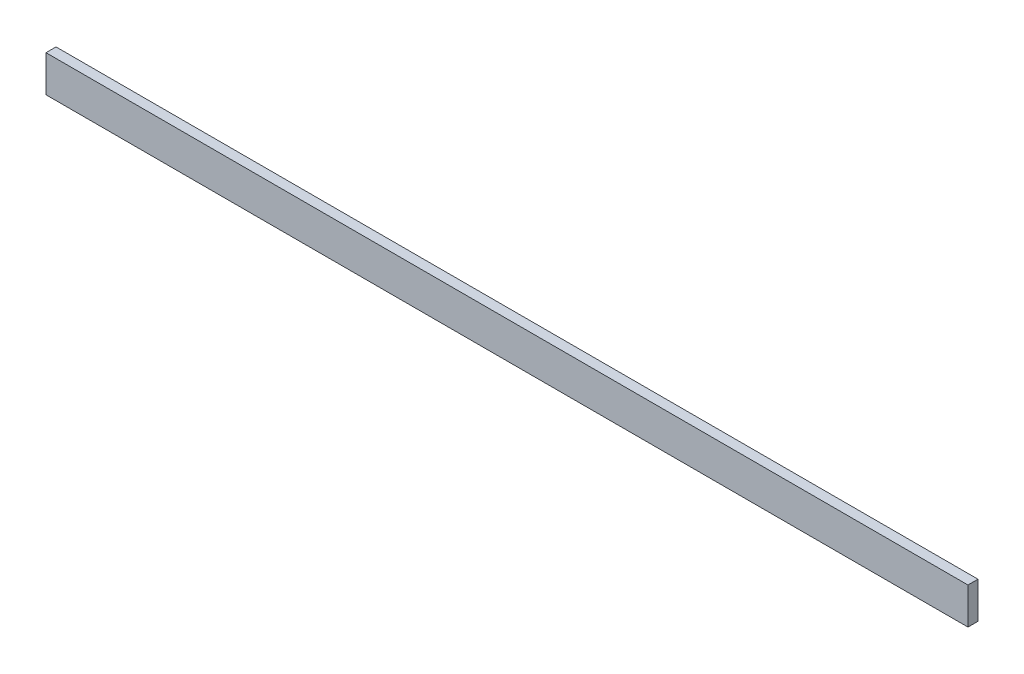
ISO-10303-21;
HEADER;
FILE_DESCRIPTION(('STEP AP214'),'2;1');
FILE_NAME('part.step','',(''),(''),'','','');
FILE_SCHEMA(('AUTOMOTIVE_DESIGN { 1 0 10303 214 1 1 1 1 }'));
ENDSEC;
DATA;
#1=APPLICATION_CONTEXT('core data for automotive mechanical design processes');
#2=APPLICATION_PROTOCOL_DEFINITION('international standard','automotive_design',2000,#1);
#3=PRODUCT_CONTEXT('',#1,'mechanical');
#4=PRODUCT('Part','Part','',(#3));
#5=PRODUCT_RELATED_PRODUCT_CATEGORY('part','',(#4));
#6=PRODUCT_DEFINITION_FORMATION('','',#4);
#7=PRODUCT_DEFINITION_CONTEXT('part definition',#1,'design');
#8=PRODUCT_DEFINITION('design','',#6,#7);
#9=PRODUCT_DEFINITION_SHAPE('','',#8);
#10=(LENGTH_UNIT() NAMED_UNIT(*) SI_UNIT(.MILLI.,.METRE.));
#11=(NAMED_UNIT(*) PLANE_ANGLE_UNIT() SI_UNIT($,.RADIAN.));
#12=(NAMED_UNIT(*) SI_UNIT($,.STERADIAN.) SOLID_ANGLE_UNIT());
#13=UNCERTAINTY_MEASURE_WITH_UNIT(LENGTH_MEASURE(1.E-05),#10,'distance_accuracy_value','');
#14=(GEOMETRIC_REPRESENTATION_CONTEXT(3) GLOBAL_UNCERTAINTY_ASSIGNED_CONTEXT((#13)) GLOBAL_UNIT_ASSIGNED_CONTEXT((#10,
#11,#12)) REPRESENTATION_CONTEXT('',''));
#15=CARTESIAN_POINT('',(0.,0.,0.));
#16=DIRECTION('',(0.,0.,1.));
#17=DIRECTION('',(1.,0.,0.));
#18=AXIS2_PLACEMENT_3D('',#15,#16,#17);
#19=CARTESIAN_POINT('',(0.,0.,22.));
#20=DIRECTION('',(1.,0.,0.));
#21=DIRECTION('',(0.,0.,-1.));
#22=AXIS2_PLACEMENT_3D('',#19,#20,#21);
#23=PLANE('',#22);
#24=DIRECTION('',(0.,-1.,0.));
#25=VECTOR('',#24,1.);
#26=CARTESIAN_POINT('',(0.,0.,0.));
#27=LINE('',#26,#25);
#28=CARTESIAN_POINT('',(0.,80.,0.));
#29=VERTEX_POINT('',#28);
#30=CARTESIAN_POINT('',(0.,0.,0.));
#31=VERTEX_POINT('',#30);
#32=EDGE_CURVE('E94',#29,#31,#27,.T.);
#33=ORIENTED_EDGE('',*,*,#32,.T.);
#34=DIRECTION('',(0.,0.,-1.));
#35=VECTOR('',#34,1.);
#36=CARTESIAN_POINT('',(0.,0.,22.));
#37=LINE('',#36,#35);
#38=CARTESIAN_POINT('',(0.,0.,22.));
#39=VERTEX_POINT('',#38);
#40=EDGE_CURVE('E11',#39,#31,#37,.T.);
#41=ORIENTED_EDGE('',*,*,#40,.F.);
#42=DIRECTION('',(0.,-1.,0.));
#43=VECTOR('',#42,1.);
#44=CARTESIAN_POINT('',(0.,0.,22.));
#45=LINE('',#44,#43);
#46=CARTESIAN_POINT('',(0.,80.,22.));
#47=VERTEX_POINT('',#46);
#48=EDGE_CURVE('E82',#47,#39,#45,.T.);
#49=ORIENTED_EDGE('',*,*,#48,.F.);
#50=DIRECTION('',(0.,0.,-1.));
#51=VECTOR('',#50,1.);
#52=CARTESIAN_POINT('',(0.,80.,22.));
#53=LINE('',#52,#51);
#54=EDGE_CURVE('E90',#47,#29,#53,.T.);
#55=ORIENTED_EDGE('',*,*,#54,.T.);
#56=EDGE_LOOP('',(#33,#41,#49,#55));
#57=FACE_BOUND('',#56,.T.);
#58=ADVANCED_FACE('F31',(#57),#23,.F.);
#59=CARTESIAN_POINT('',(0.,0.,22.));
#60=DIRECTION('',(0.,1.,0.));
#61=DIRECTION('',(0.,0.,1.));
#62=AXIS2_PLACEMENT_3D('',#59,#60,#61);
#63=PLANE('',#62);
#64=DIRECTION('',(1.,0.,0.));
#65=VECTOR('',#64,1.);
#66=CARTESIAN_POINT('',(0.,0.,0.));
#67=LINE('',#66,#65);
#68=CARTESIAN_POINT('',(2022.,0.,0.));
#69=VERTEX_POINT('',#68);
#70=EDGE_CURVE('E86',#31,#69,#67,.T.);
#71=ORIENTED_EDGE('',*,*,#70,.T.);
#72=DIRECTION('',(0.,0.,-1.));
#73=VECTOR('',#72,1.);
#74=CARTESIAN_POINT('',(2022.,0.,22.));
#75=LINE('',#74,#73);
#76=CARTESIAN_POINT('',(2022.,0.,22.));
#77=VERTEX_POINT('',#76);
#78=EDGE_CURVE('E39',#77,#69,#75,.T.);
#79=ORIENTED_EDGE('',*,*,#78,.F.);
#80=DIRECTION('',(1.,0.,0.));
#81=VECTOR('',#80,1.);
#82=CARTESIAN_POINT('',(0.,0.,22.));
#83=LINE('',#82,#81);
#84=EDGE_CURVE('E77',#39,#77,#83,.T.);
#85=ORIENTED_EDGE('',*,*,#84,.F.);
#86=ORIENTED_EDGE('',*,*,#40,.T.);
#87=EDGE_LOOP('',(#71,#79,#85,#86));
#88=FACE_BOUND('',#87,.T.);
#89=ADVANCED_FACE('F85',(#88),#63,.F.);
#90=CARTESIAN_POINT('',(2022.,0.,22.));
#91=DIRECTION('',(-1.,0.,0.));
#92=DIRECTION('',(0.,0.,1.));
#93=AXIS2_PLACEMENT_3D('',#90,#91,#92);
#94=PLANE('',#93);
#95=DIRECTION('',(0.,1.,0.));
#96=VECTOR('',#95,1.);
#97=CARTESIAN_POINT('',(2022.,0.,0.));
#98=LINE('',#97,#96);
#99=CARTESIAN_POINT('',(2022.,80.,0.));
#100=VERTEX_POINT('',#99);
#101=EDGE_CURVE('E64',#69,#100,#98,.T.);
#102=ORIENTED_EDGE('',*,*,#101,.T.);
#103=DIRECTION('',(0.,0.,-1.));
#104=VECTOR('',#103,1.);
#105=CARTESIAN_POINT('',(2022.,80.,22.));
#106=LINE('',#105,#104);
#107=CARTESIAN_POINT('',(2022.,80.,22.));
#108=VERTEX_POINT('',#107);
#109=EDGE_CURVE('E87',#108,#100,#106,.T.);
#110=ORIENTED_EDGE('',*,*,#109,.F.);
#111=DIRECTION('',(0.,1.,0.));
#112=VECTOR('',#111,1.);
#113=CARTESIAN_POINT('',(2022.,0.,22.));
#114=LINE('',#113,#112);
#115=EDGE_CURVE('E80',#77,#108,#114,.T.);
#116=ORIENTED_EDGE('',*,*,#115,.F.);
#117=ORIENTED_EDGE('',*,*,#78,.T.);
#118=EDGE_LOOP('',(#102,#110,#116,#117));
#119=FACE_BOUND('',#118,.T.);
#120=ADVANCED_FACE('F88',(#119),#94,.F.);
#121=CARTESIAN_POINT('',(0.,80.,22.));
#122=DIRECTION('',(0.,-1.,0.));
#123=DIRECTION('',(0.,0.,-1.));
#124=AXIS2_PLACEMENT_3D('',#121,#122,#123);
#125=PLANE('',#124);
#126=DIRECTION('',(-1.,0.,0.));
#127=VECTOR('',#126,1.);
#128=CARTESIAN_POINT('',(0.,80.,0.));
#129=LINE('',#128,#127);
#130=EDGE_CURVE('E70',#100,#29,#129,.T.);
#131=ORIENTED_EDGE('',*,*,#130,.T.);
#132=ORIENTED_EDGE('',*,*,#54,.F.);
#133=DIRECTION('',(-1.,0.,0.));
#134=VECTOR('',#133,1.);
#135=CARTESIAN_POINT('',(0.,80.,22.));
#136=LINE('',#135,#134);
#137=EDGE_CURVE('E47',#108,#47,#136,.T.);
#138=ORIENTED_EDGE('',*,*,#137,.F.);
#139=ORIENTED_EDGE('',*,*,#109,.T.);
#140=EDGE_LOOP('',(#131,#132,#138,#139));
#141=FACE_BOUND('',#140,.T.);
#142=ADVANCED_FACE('F101',(#141),#125,.F.);
#143=CARTESIAN_POINT('',(0.,80.,22.));
#144=DIRECTION('',(0.,0.,-1.));
#145=DIRECTION('',(-1.,0.,0.));
#146=AXIS2_PLACEMENT_3D('',#143,#144,#145);
#147=PLANE('',#146);
#148=ORIENTED_EDGE('',*,*,#48,.T.);
#149=ORIENTED_EDGE('',*,*,#84,.T.);
#150=ORIENTED_EDGE('',*,*,#115,.T.);
#151=ORIENTED_EDGE('',*,*,#137,.T.);
#152=EDGE_LOOP('',(#148,#149,#150,#151));
#153=FACE_BOUND('',#152,.T.);
#154=ADVANCED_FACE('F78',(#153),#147,.F.);
#155=CARTESIAN_POINT('',(0.,80.,0.));
#156=DIRECTION('',(0.,0.,-1.));
#157=DIRECTION('',(-1.,0.,0.));
#158=AXIS2_PLACEMENT_3D('',#155,#156,#157);
#159=PLANE('',#158);
#160=ORIENTED_EDGE('',*,*,#32,.F.);
#161=ORIENTED_EDGE('',*,*,#130,.F.);
#162=ORIENTED_EDGE('',*,*,#101,.F.);
#163=ORIENTED_EDGE('',*,*,#70,.F.);
#164=EDGE_LOOP('',(#160,#161,#162,#163));
#165=FACE_BOUND('',#164,.T.);
#166=ADVANCED_FACE('F104',(#165),#159,.T.);
#167=CLOSED_SHELL('',(#58,#89,#120,#142,#154,#166));
#168=MANIFOLD_SOLID_BREP('B2',#167);
#169=ADVANCED_BREP_SHAPE_REPRESENTATION('',(#18,#168),#14);
#170=SHAPE_DEFINITION_REPRESENTATION(#9,#169);
ENDSEC;
END-ISO-10303-21;
